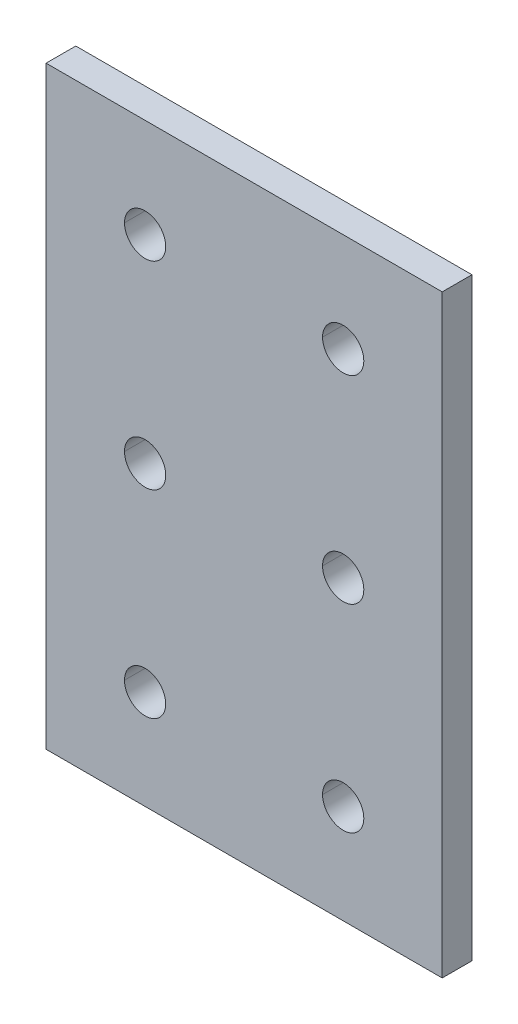
ISO-10303-21;
HEADER;
FILE_DESCRIPTION(('STEP AP214'),'2;1');
FILE_NAME('part.step','',(''),(''),'','','');
FILE_SCHEMA(('AUTOMOTIVE_DESIGN { 1 0 10303 214 1 1 1 1 }'));
ENDSEC;
DATA;
#1=APPLICATION_CONTEXT('core data for automotive mechanical design processes');
#2=APPLICATION_PROTOCOL_DEFINITION('international standard','automotive_design',2000,#1);
#3=PRODUCT_CONTEXT('',#1,'mechanical');
#4=PRODUCT('Part','Part','',(#3));
#5=PRODUCT_RELATED_PRODUCT_CATEGORY('part','',(#4));
#6=PRODUCT_DEFINITION_FORMATION('','',#4);
#7=PRODUCT_DEFINITION_CONTEXT('part definition',#1,'design');
#8=PRODUCT_DEFINITION('design','',#6,#7);
#9=PRODUCT_DEFINITION_SHAPE('','',#8);
#10=(LENGTH_UNIT() NAMED_UNIT(*) SI_UNIT(.MILLI.,.METRE.));
#11=(NAMED_UNIT(*) PLANE_ANGLE_UNIT() SI_UNIT($,.RADIAN.));
#12=(NAMED_UNIT(*) SI_UNIT($,.STERADIAN.) SOLID_ANGLE_UNIT());
#13=UNCERTAINTY_MEASURE_WITH_UNIT(LENGTH_MEASURE(1.E-05),#10,'distance_accuracy_value','');
#14=(GEOMETRIC_REPRESENTATION_CONTEXT(3) GLOBAL_UNCERTAINTY_ASSIGNED_CONTEXT((#13)) GLOBAL_UNIT_ASSIGNED_CONTEXT((#10,
#11,#12)) REPRESENTATION_CONTEXT('',''));
#15=CARTESIAN_POINT('',(0.,0.,0.));
#16=DIRECTION('',(0.,0.,1.));
#17=DIRECTION('',(1.,0.,0.));
#18=AXIS2_PLACEMENT_3D('',#15,#16,#17);
#19=CARTESIAN_POINT('',(40.,120.,6.));
#20=DIRECTION('',(0.,-1.,0.));
#21=DIRECTION('',(0.,0.,-1.));
#22=AXIS2_PLACEMENT_3D('',#19,#20,#21);
#23=PLANE('',#22);
#24=DIRECTION('',(-1.,0.,0.));
#25=VECTOR('',#24,1.);
#26=CARTESIAN_POINT('',(40.,120.,0.));
#27=LINE('',#26,#25);
#28=CARTESIAN_POINT('',(40.,120.,0.));
#29=VERTEX_POINT('',#28);
#30=CARTESIAN_POINT('',(-40.,120.,0.));
#31=VERTEX_POINT('',#30);
#32=EDGE_CURVE('E10',#29,#31,#27,.T.);
#33=ORIENTED_EDGE('',*,*,#32,.T.);
#34=DIRECTION('',(0.,0.,-1.));
#35=VECTOR('',#34,1.);
#36=CARTESIAN_POINT('',(-40.,120.,6.));
#37=LINE('',#36,#35);
#38=CARTESIAN_POINT('',(-40.,120.,6.));
#39=VERTEX_POINT('',#38);
#40=EDGE_CURVE('E24',#39,#31,#37,.T.);
#41=ORIENTED_EDGE('',*,*,#40,.F.);
#42=DIRECTION('',(-1.,0.,0.));
#43=VECTOR('',#42,1.);
#44=CARTESIAN_POINT('',(40.,120.,6.));
#45=LINE('',#44,#43);
#46=CARTESIAN_POINT('',(40.,120.,6.));
#47=VERTEX_POINT('',#46);
#48=EDGE_CURVE('E304',#47,#39,#45,.T.);
#49=ORIENTED_EDGE('',*,*,#48,.F.);
#50=DIRECTION('',(0.,0.,-1.));
#51=VECTOR('',#50,1.);
#52=CARTESIAN_POINT('',(40.,120.,6.));
#53=LINE('',#52,#51);
#54=EDGE_CURVE('E300',#47,#29,#53,.T.);
#55=ORIENTED_EDGE('',*,*,#54,.T.);
#56=EDGE_LOOP('',(#33,#41,#49,#55));
#57=FACE_BOUND('',#56,.T.);
#58=ADVANCED_FACE('F16',(#57),#23,.F.);
#59=CARTESIAN_POINT('',(40.,0.,6.));
#60=DIRECTION('',(-1.,0.,0.));
#61=DIRECTION('',(0.,0.,1.));
#62=AXIS2_PLACEMENT_3D('',#59,#60,#61);
#63=PLANE('',#62);
#64=DIRECTION('',(0.,1.,0.));
#65=VECTOR('',#64,1.);
#66=CARTESIAN_POINT('',(40.,0.,0.));
#67=LINE('',#66,#65);
#68=CARTESIAN_POINT('',(40.,0.,0.));
#69=VERTEX_POINT('',#68);
#70=EDGE_CURVE('E295',#69,#29,#67,.T.);
#71=ORIENTED_EDGE('',*,*,#70,.T.);
#72=ORIENTED_EDGE('',*,*,#54,.F.);
#73=DIRECTION('',(0.,1.,0.));
#74=VECTOR('',#73,1.);
#75=CARTESIAN_POINT('',(40.,0.,6.));
#76=LINE('',#75,#74);
#77=CARTESIAN_POINT('',(40.,0.,6.));
#78=VERTEX_POINT('',#77);
#79=EDGE_CURVE('E290',#78,#47,#76,.T.);
#80=ORIENTED_EDGE('',*,*,#79,.F.);
#81=DIRECTION('',(0.,0.,-1.));
#82=VECTOR('',#81,1.);
#83=CARTESIAN_POINT('',(40.,0.,6.));
#84=LINE('',#83,#82);
#85=EDGE_CURVE('E286',#78,#69,#84,.T.);
#86=ORIENTED_EDGE('',*,*,#85,.T.);
#87=EDGE_LOOP('',(#71,#72,#80,#86));
#88=FACE_BOUND('',#87,.T.);
#89=ADVANCED_FACE('F322',(#88),#63,.F.);
#90=CARTESIAN_POINT('',(-40.,0.,6.));
#91=DIRECTION('',(0.,1.,0.));
#92=DIRECTION('',(0.,0.,1.));
#93=AXIS2_PLACEMENT_3D('',#90,#91,#92);
#94=PLANE('',#93);
#95=DIRECTION('',(1.,0.,0.));
#96=VECTOR('',#95,1.);
#97=CARTESIAN_POINT('',(-40.,0.,0.));
#98=LINE('',#97,#96);
#99=CARTESIAN_POINT('',(-40.,0.,0.));
#100=VERTEX_POINT('',#99);
#101=EDGE_CURVE('E281',#100,#69,#98,.T.);
#102=ORIENTED_EDGE('',*,*,#101,.T.);
#103=ORIENTED_EDGE('',*,*,#85,.F.);
#104=DIRECTION('',(1.,0.,0.));
#105=VECTOR('',#104,1.);
#106=CARTESIAN_POINT('',(-40.,0.,6.));
#107=LINE('',#106,#105);
#108=CARTESIAN_POINT('',(-40.,0.,6.));
#109=VERTEX_POINT('',#108);
#110=EDGE_CURVE('E276',#109,#78,#107,.T.);
#111=ORIENTED_EDGE('',*,*,#110,.F.);
#112=DIRECTION('',(0.,0.,-1.));
#113=VECTOR('',#112,1.);
#114=CARTESIAN_POINT('',(-40.,0.,6.));
#115=LINE('',#114,#113);
#116=EDGE_CURVE('E272',#109,#100,#115,.T.);
#117=ORIENTED_EDGE('',*,*,#116,.T.);
#118=EDGE_LOOP('',(#102,#103,#111,#117));
#119=FACE_BOUND('',#118,.T.);
#120=ADVANCED_FACE('F326',(#119),#94,.F.);
#121=CARTESIAN_POINT('',(-40.,120.,6.));
#122=DIRECTION('',(1.,0.,0.));
#123=DIRECTION('',(0.,0.,-1.));
#124=AXIS2_PLACEMENT_3D('',#121,#122,#123);
#125=PLANE('',#124);
#126=DIRECTION('',(0.,-1.,0.));
#127=VECTOR('',#126,1.);
#128=CARTESIAN_POINT('',(-40.,120.,0.));
#129=LINE('',#128,#127);
#130=EDGE_CURVE('E267',#31,#100,#129,.T.);
#131=ORIENTED_EDGE('',*,*,#130,.T.);
#132=ORIENTED_EDGE('',*,*,#116,.F.);
#133=DIRECTION('',(0.,-1.,0.));
#134=VECTOR('',#133,1.);
#135=CARTESIAN_POINT('',(-40.,120.,6.));
#136=LINE('',#135,#134);
#137=EDGE_CURVE('E262',#39,#109,#136,.T.);
#138=ORIENTED_EDGE('',*,*,#137,.F.);
#139=ORIENTED_EDGE('',*,*,#40,.T.);
#140=EDGE_LOOP('',(#131,#132,#138,#139));
#141=FACE_BOUND('',#140,.T.);
#142=ADVANCED_FACE('F314',(#141),#125,.F.);
#143=CARTESIAN_POINT('',(0.,0.,6.));
#144=DIRECTION('',(0.,0.,1.));
#145=DIRECTION('',(1.,0.,0.));
#146=AXIS2_PLACEMENT_3D('',#143,#144,#145);
#147=PLANE('',#146);
#148=CARTESIAN_POINT('',(-20.,100.,6.));
#149=DIRECTION('',(0.,0.,1.));
#150=DIRECTION('',(1.,0.,0.));
#151=AXIS2_PLACEMENT_3D('',#148,#149,#150);
#152=CIRCLE('',#151,4.165);
#153=CARTESIAN_POINT('',(-24.165,100.,6.));
#154=VERTEX_POINT('',#153);
#155=CARTESIAN_POINT('',(-15.835,100.,6.));
#156=VERTEX_POINT('',#155);
#157=EDGE_CURVE('E257',#154,#156,#152,.T.);
#158=ORIENTED_EDGE('',*,*,#157,.F.);
#159=CARTESIAN_POINT('',(-20.,100.,6.));
#160=DIRECTION('',(0.,0.,1.));
#161=DIRECTION('',(1.,0.,0.));
#162=AXIS2_PLACEMENT_3D('',#159,#160,#161);
#163=CIRCLE('',#162,4.165);
#164=EDGE_CURVE('E252',#156,#154,#163,.T.);
#165=ORIENTED_EDGE('',*,*,#164,.F.);
#166=EDGE_LOOP('',(#158,#165));
#167=FACE_BOUND('',#166,.T.);
#168=CARTESIAN_POINT('',(-20.,60.,6.));
#169=DIRECTION('',(0.,0.,1.));
#170=DIRECTION('',(1.,0.,0.));
#171=AXIS2_PLACEMENT_3D('',#168,#169,#170);
#172=CIRCLE('',#171,4.165);
#173=CARTESIAN_POINT('',(-24.165,60.,6.));
#174=VERTEX_POINT('',#173);
#175=CARTESIAN_POINT('',(-15.835,60.,6.));
#176=VERTEX_POINT('',#175);
#177=EDGE_CURVE('E247',#174,#176,#172,.T.);
#178=ORIENTED_EDGE('',*,*,#177,.F.);
#179=CARTESIAN_POINT('',(-20.,60.,6.));
#180=DIRECTION('',(0.,0.,1.));
#181=DIRECTION('',(1.,0.,0.));
#182=AXIS2_PLACEMENT_3D('',#179,#180,#181);
#183=CIRCLE('',#182,4.165);
#184=EDGE_CURVE('E242',#176,#174,#183,.T.);
#185=ORIENTED_EDGE('',*,*,#184,.F.);
#186=EDGE_LOOP('',(#178,#185));
#187=FACE_BOUND('',#186,.T.);
#188=CARTESIAN_POINT('',(-20.,20.,6.));
#189=DIRECTION('',(0.,0.,1.));
#190=DIRECTION('',(1.,0.,0.));
#191=AXIS2_PLACEMENT_3D('',#188,#189,#190);
#192=CIRCLE('',#191,4.165);
#193=CARTESIAN_POINT('',(-24.165,20.,6.));
#194=VERTEX_POINT('',#193);
#195=CARTESIAN_POINT('',(-15.835,20.,6.));
#196=VERTEX_POINT('',#195);
#197=EDGE_CURVE('E237',#194,#196,#192,.T.);
#198=ORIENTED_EDGE('',*,*,#197,.F.);
#199=CARTESIAN_POINT('',(-20.,20.,6.));
#200=DIRECTION('',(0.,0.,1.));
#201=DIRECTION('',(1.,0.,0.));
#202=AXIS2_PLACEMENT_3D('',#199,#200,#201);
#203=CIRCLE('',#202,4.165);
#204=EDGE_CURVE('E232',#196,#194,#203,.T.);
#205=ORIENTED_EDGE('',*,*,#204,.F.);
#206=EDGE_LOOP('',(#198,#205));
#207=FACE_BOUND('',#206,.T.);
#208=CARTESIAN_POINT('',(20.,100.,6.));
#209=DIRECTION('',(0.,0.,1.));
#210=DIRECTION('',(1.,0.,0.));
#211=AXIS2_PLACEMENT_3D('',#208,#209,#210);
#212=CIRCLE('',#211,4.165);
#213=CARTESIAN_POINT('',(15.835,100.,6.));
#214=VERTEX_POINT('',#213);
#215=CARTESIAN_POINT('',(24.165,100.,6.));
#216=VERTEX_POINT('',#215);
#217=EDGE_CURVE('E227',#214,#216,#212,.T.);
#218=ORIENTED_EDGE('',*,*,#217,.F.);
#219=CARTESIAN_POINT('',(20.,100.,6.));
#220=DIRECTION('',(0.,0.,1.));
#221=DIRECTION('',(1.,0.,0.));
#222=AXIS2_PLACEMENT_3D('',#219,#220,#221);
#223=CIRCLE('',#222,4.165);
#224=EDGE_CURVE('E222',#216,#214,#223,.T.);
#225=ORIENTED_EDGE('',*,*,#224,.F.);
#226=EDGE_LOOP('',(#218,#225));
#227=FACE_BOUND('',#226,.T.);
#228=CARTESIAN_POINT('',(20.,60.,6.));
#229=DIRECTION('',(0.,0.,1.));
#230=DIRECTION('',(1.,0.,0.));
#231=AXIS2_PLACEMENT_3D('',#228,#229,#230);
#232=CIRCLE('',#231,4.165);
#233=CARTESIAN_POINT('',(15.835,60.,6.));
#234=VERTEX_POINT('',#233);
#235=CARTESIAN_POINT('',(24.165,60.,6.));
#236=VERTEX_POINT('',#235);
#237=EDGE_CURVE('E145',#234,#236,#232,.T.);
#238=ORIENTED_EDGE('',*,*,#237,.F.);
#239=CARTESIAN_POINT('',(20.,60.,6.));
#240=DIRECTION('',(0.,0.,1.));
#241=DIRECTION('',(1.,0.,0.));
#242=AXIS2_PLACEMENT_3D('',#239,#240,#241);
#243=CIRCLE('',#242,4.165);
#244=EDGE_CURVE('E215',#236,#234,#243,.T.);
#245=ORIENTED_EDGE('',*,*,#244,.F.);
#246=EDGE_LOOP('',(#238,#245));
#247=FACE_BOUND('',#246,.T.);
#248=CARTESIAN_POINT('',(20.,20.,6.));
#249=DIRECTION('',(0.,0.,1.));
#250=DIRECTION('',(1.,0.,0.));
#251=AXIS2_PLACEMENT_3D('',#248,#249,#250);
#252=CIRCLE('',#251,4.165);
#253=CARTESIAN_POINT('',(15.835,20.,6.));
#254=VERTEX_POINT('',#253);
#255=CARTESIAN_POINT('',(24.165,20.,6.));
#256=VERTEX_POINT('',#255);
#257=EDGE_CURVE('E210',#254,#256,#252,.T.);
#258=ORIENTED_EDGE('',*,*,#257,.F.);
#259=CARTESIAN_POINT('',(20.,20.,6.));
#260=DIRECTION('',(0.,0.,1.));
#261=DIRECTION('',(1.,0.,0.));
#262=AXIS2_PLACEMENT_3D('',#259,#260,#261);
#263=CIRCLE('',#262,4.165);
#264=EDGE_CURVE('E205',#256,#254,#263,.T.);
#265=ORIENTED_EDGE('',*,*,#264,.F.);
#266=EDGE_LOOP('',(#258,#265));
#267=FACE_BOUND('',#266,.T.);
#268=ORIENTED_EDGE('',*,*,#48,.T.);
#269=ORIENTED_EDGE('',*,*,#137,.T.);
#270=ORIENTED_EDGE('',*,*,#110,.T.);
#271=ORIENTED_EDGE('',*,*,#79,.T.);
#272=EDGE_LOOP('',(#268,#269,#270,#271));
#273=FACE_BOUND('',#272,.T.);
#274=ADVANCED_FACE('F318',(#167,#187,#207,#227,#247,#267,#273),#147,.T.);
#275=CARTESIAN_POINT('',(20.,20.,6.));
#276=DIRECTION('',(0.,0.,-1.));
#277=DIRECTION('',(0.,-1.,0.));
#278=AXIS2_PLACEMENT_3D('',#275,#276,#277);
#279=CYLINDRICAL_SURFACE('',#278,4.165);
#280=DIRECTION('',(0.,0.,-1.));
#281=VECTOR('',#280,1.);
#282=CARTESIAN_POINT('',(24.165,20.,6.));
#283=LINE('',#282,#281);
#284=CARTESIAN_POINT('',(24.165,20.,0.));
#285=VERTEX_POINT('',#284);
#286=EDGE_CURVE('E200',#256,#285,#283,.T.);
#287=ORIENTED_EDGE('',*,*,#286,.F.);
#288=ORIENTED_EDGE('',*,*,#264,.T.);
#289=DIRECTION('',(0.,0.,-1.));
#290=VECTOR('',#289,1.);
#291=CARTESIAN_POINT('',(15.835,20.,6.));
#292=LINE('',#291,#290);
#293=CARTESIAN_POINT('',(15.835,20.,0.));
#294=VERTEX_POINT('',#293);
#295=EDGE_CURVE('E196',#254,#294,#292,.T.);
#296=ORIENTED_EDGE('',*,*,#295,.T.);
#297=CARTESIAN_POINT('',(20.,20.,0.));
#298=DIRECTION('',(0.,0.,1.));
#299=DIRECTION('',(1.,0.,0.));
#300=AXIS2_PLACEMENT_3D('',#297,#298,#299);
#301=CIRCLE('',#300,4.165);
#302=EDGE_CURVE('E191',#285,#294,#301,.T.);
#303=ORIENTED_EDGE('',*,*,#302,.F.);
#304=EDGE_LOOP('',(#287,#288,#296,#303));
#305=FACE_BOUND('',#304,.T.);
#306=ADVANCED_FACE('F369',(#305),#279,.F.);
#307=CARTESIAN_POINT('',(0.,0.,0.));
#308=DIRECTION('',(0.,0.,1.));
#309=DIRECTION('',(1.,0.,0.));
#310=AXIS2_PLACEMENT_3D('',#307,#308,#309);
#311=PLANE('',#310);
#312=CARTESIAN_POINT('',(-20.,100.,0.));
#313=DIRECTION('',(0.,0.,1.));
#314=DIRECTION('',(1.,0.,0.));
#315=AXIS2_PLACEMENT_3D('',#312,#313,#314);
#316=CIRCLE('',#315,4.165);
#317=CARTESIAN_POINT('',(-15.835,100.,0.));
#318=VERTEX_POINT('',#317);
#319=CARTESIAN_POINT('',(-24.165,100.,0.));
#320=VERTEX_POINT('',#319);
#321=EDGE_CURVE('E187',#318,#320,#316,.T.);
#322=ORIENTED_EDGE('',*,*,#321,.T.);
#323=CARTESIAN_POINT('',(-20.,100.,0.));
#324=DIRECTION('',(0.,0.,1.));
#325=DIRECTION('',(1.,0.,0.));
#326=AXIS2_PLACEMENT_3D('',#323,#324,#325);
#327=CIRCLE('',#326,4.165);
#328=EDGE_CURVE('E183',#320,#318,#327,.T.);
#329=ORIENTED_EDGE('',*,*,#328,.T.);
#330=EDGE_LOOP('',(#322,#329));
#331=FACE_BOUND('',#330,.T.);
#332=CARTESIAN_POINT('',(-20.,60.,0.));
#333=DIRECTION('',(0.,0.,1.));
#334=DIRECTION('',(1.,0.,0.));
#335=AXIS2_PLACEMENT_3D('',#332,#333,#334);
#336=CIRCLE('',#335,4.165);
#337=CARTESIAN_POINT('',(-15.835,60.,0.));
#338=VERTEX_POINT('',#337);
#339=CARTESIAN_POINT('',(-24.165,60.,0.));
#340=VERTEX_POINT('',#339);
#341=EDGE_CURVE('E179',#338,#340,#336,.T.);
#342=ORIENTED_EDGE('',*,*,#341,.T.);
#343=CARTESIAN_POINT('',(-20.,60.,0.));
#344=DIRECTION('',(0.,0.,1.));
#345=DIRECTION('',(1.,0.,0.));
#346=AXIS2_PLACEMENT_3D('',#343,#344,#345);
#347=CIRCLE('',#346,4.165);
#348=EDGE_CURVE('E175',#340,#338,#347,.T.);
#349=ORIENTED_EDGE('',*,*,#348,.T.);
#350=EDGE_LOOP('',(#342,#349));
#351=FACE_BOUND('',#350,.T.);
#352=CARTESIAN_POINT('',(-20.,20.,0.));
#353=DIRECTION('',(0.,0.,1.));
#354=DIRECTION('',(1.,0.,0.));
#355=AXIS2_PLACEMENT_3D('',#352,#353,#354);
#356=CIRCLE('',#355,4.165);
#357=CARTESIAN_POINT('',(-15.835,20.,0.));
#358=VERTEX_POINT('',#357);
#359=CARTESIAN_POINT('',(-24.165,20.,0.));
#360=VERTEX_POINT('',#359);
#361=EDGE_CURVE('E171',#358,#360,#356,.T.);
#362=ORIENTED_EDGE('',*,*,#361,.T.);
#363=CARTESIAN_POINT('',(-20.,20.,0.));
#364=DIRECTION('',(0.,0.,1.));
#365=DIRECTION('',(1.,0.,0.));
#366=AXIS2_PLACEMENT_3D('',#363,#364,#365);
#367=CIRCLE('',#366,4.165);
#368=EDGE_CURVE('E167',#360,#358,#367,.T.);
#369=ORIENTED_EDGE('',*,*,#368,.T.);
#370=EDGE_LOOP('',(#362,#369));
#371=FACE_BOUND('',#370,.T.);
#372=CARTESIAN_POINT('',(20.,100.,0.));
#373=DIRECTION('',(0.,0.,1.));
#374=DIRECTION('',(1.,0.,0.));
#375=AXIS2_PLACEMENT_3D('',#372,#373,#374);
#376=CIRCLE('',#375,4.165);
#377=CARTESIAN_POINT('',(24.165,100.,0.));
#378=VERTEX_POINT('',#377);
#379=CARTESIAN_POINT('',(15.835,100.,0.));
#380=VERTEX_POINT('',#379);
#381=EDGE_CURVE('E163',#378,#380,#376,.T.);
#382=ORIENTED_EDGE('',*,*,#381,.T.);
#383=CARTESIAN_POINT('',(20.,100.,0.));
#384=DIRECTION('',(0.,0.,1.));
#385=DIRECTION('',(1.,0.,0.));
#386=AXIS2_PLACEMENT_3D('',#383,#384,#385);
#387=CIRCLE('',#386,4.165);
#388=EDGE_CURVE('E142',#380,#378,#387,.T.);
#389=ORIENTED_EDGE('',*,*,#388,.T.);
#390=EDGE_LOOP('',(#382,#389));
#391=FACE_BOUND('',#390,.T.);
#392=CARTESIAN_POINT('',(20.,60.,0.));
#393=DIRECTION('',(0.,0.,1.));
#394=DIRECTION('',(1.,0.,0.));
#395=AXIS2_PLACEMENT_3D('',#392,#393,#394);
#396=CIRCLE('',#395,4.165);
#397=CARTESIAN_POINT('',(24.165,60.,0.));
#398=VERTEX_POINT('',#397);
#399=CARTESIAN_POINT('',(15.835,60.,0.));
#400=VERTEX_POINT('',#399);
#401=EDGE_CURVE('E128',#398,#400,#396,.T.);
#402=ORIENTED_EDGE('',*,*,#401,.T.);
#403=CARTESIAN_POINT('',(20.,60.,0.));
#404=DIRECTION('',(0.,0.,1.));
#405=DIRECTION('',(1.,0.,0.));
#406=AXIS2_PLACEMENT_3D('',#403,#404,#405);
#407=CIRCLE('',#406,4.165);
#408=EDGE_CURVE('E124',#400,#398,#407,.T.);
#409=ORIENTED_EDGE('',*,*,#408,.T.);
#410=EDGE_LOOP('',(#402,#409));
#411=FACE_BOUND('',#410,.T.);
#412=ORIENTED_EDGE('',*,*,#302,.T.);
#413=CARTESIAN_POINT('',(20.,20.,0.));
#414=DIRECTION('',(0.,0.,1.));
#415=DIRECTION('',(1.,0.,0.));
#416=AXIS2_PLACEMENT_3D('',#413,#414,#415);
#417=CIRCLE('',#416,4.165);
#418=EDGE_CURVE('E133',#294,#285,#417,.T.);
#419=ORIENTED_EDGE('',*,*,#418,.T.);
#420=EDGE_LOOP('',(#412,#419));
#421=FACE_BOUND('',#420,.T.);
#422=ORIENTED_EDGE('',*,*,#32,.F.);
#423=ORIENTED_EDGE('',*,*,#70,.F.);
#424=ORIENTED_EDGE('',*,*,#101,.F.);
#425=ORIENTED_EDGE('',*,*,#130,.F.);
#426=EDGE_LOOP('',(#422,#423,#424,#425));
#427=FACE_BOUND('',#426,.T.);
#428=ADVANCED_FACE('F126',(#331,#351,#371,#391,#411,#421,#427),#311,.F.);
#429=CARTESIAN_POINT('',(20.,20.,6.));
#430=DIRECTION('',(0.,0.,-1.));
#431=DIRECTION('',(0.,1.,0.));
#432=AXIS2_PLACEMENT_3D('',#429,#430,#431);
#433=CYLINDRICAL_SURFACE('',#432,4.165);
#434=ORIENTED_EDGE('',*,*,#286,.T.);
#435=ORIENTED_EDGE('',*,*,#418,.F.);
#436=ORIENTED_EDGE('',*,*,#295,.F.);
#437=ORIENTED_EDGE('',*,*,#257,.T.);
#438=EDGE_LOOP('',(#434,#435,#436,#437));
#439=FACE_BOUND('',#438,.T.);
#440=ADVANCED_FACE('F390',(#439),#433,.F.);
#441=CARTESIAN_POINT('',(20.,60.,6.));
#442=DIRECTION('',(0.,0.,-1.));
#443=DIRECTION('',(0.,1.,0.));
#444=AXIS2_PLACEMENT_3D('',#441,#442,#443);
#445=CYLINDRICAL_SURFACE('',#444,4.165);
#446=DIRECTION('',(0.,0.,-1.));
#447=VECTOR('',#446,1.);
#448=CARTESIAN_POINT('',(24.165,60.,6.));
#449=LINE('',#448,#447);
#450=EDGE_CURVE('E139',#236,#398,#449,.T.);
#451=ORIENTED_EDGE('',*,*,#450,.T.);
#452=ORIENTED_EDGE('',*,*,#408,.F.);
#453=DIRECTION('',(0.,0.,-1.));
#454=VECTOR('',#453,1.);
#455=CARTESIAN_POINT('',(15.835,60.,6.));
#456=LINE('',#455,#454);
#457=EDGE_CURVE('E141',#234,#400,#456,.T.);
#458=ORIENTED_EDGE('',*,*,#457,.F.);
#459=ORIENTED_EDGE('',*,*,#237,.T.);
#460=EDGE_LOOP('',(#451,#452,#458,#459));
#461=FACE_BOUND('',#460,.T.);
#462=ADVANCED_FACE('F144',(#461),#445,.F.);
#463=CARTESIAN_POINT('',(20.,60.,6.));
#464=DIRECTION('',(0.,0.,-1.));
#465=DIRECTION('',(0.,-1.,0.));
#466=AXIS2_PLACEMENT_3D('',#463,#464,#465);
#467=CYLINDRICAL_SURFACE('',#466,4.165);
#468=ORIENTED_EDGE('',*,*,#450,.F.);
#469=ORIENTED_EDGE('',*,*,#244,.T.);
#470=ORIENTED_EDGE('',*,*,#457,.T.);
#471=ORIENTED_EDGE('',*,*,#401,.F.);
#472=EDGE_LOOP('',(#468,#469,#470,#471));
#473=FACE_BOUND('',#472,.T.);
#474=ADVANCED_FACE('F137',(#473),#467,.F.);
#475=CARTESIAN_POINT('',(20.,100.,6.));
#476=DIRECTION('',(0.,0.,-1.));
#477=DIRECTION('',(0.,1.,0.));
#478=AXIS2_PLACEMENT_3D('',#475,#476,#477);
#479=CYLINDRICAL_SURFACE('',#478,4.165);
#480=DIRECTION('',(0.,0.,-1.));
#481=VECTOR('',#480,1.);
#482=CARTESIAN_POINT('',(24.165,100.,6.));
#483=LINE('',#482,#481);
#484=EDGE_CURVE('E149',#216,#378,#483,.T.);
#485=ORIENTED_EDGE('',*,*,#484,.T.);
#486=ORIENTED_EDGE('',*,*,#388,.F.);
#487=DIRECTION('',(0.,0.,-1.));
#488=VECTOR('',#487,1.);
#489=CARTESIAN_POINT('',(15.835,100.,6.));
#490=LINE('',#489,#488);
#491=EDGE_CURVE('E562',#214,#380,#490,.T.);
#492=ORIENTED_EDGE('',*,*,#491,.F.);
#493=ORIENTED_EDGE('',*,*,#217,.T.);
#494=EDGE_LOOP('',(#485,#486,#492,#493));
#495=FACE_BOUND('',#494,.T.);
#496=ADVANCED_FACE('F420',(#495),#479,.F.);
#497=CARTESIAN_POINT('',(20.,100.,6.));
#498=DIRECTION('',(0.,0.,-1.));
#499=DIRECTION('',(0.,-1.,0.));
#500=AXIS2_PLACEMENT_3D('',#497,#498,#499);
#501=CYLINDRICAL_SURFACE('',#500,4.165);
#502=ORIENTED_EDGE('',*,*,#484,.F.);
#503=ORIENTED_EDGE('',*,*,#224,.T.);
#504=ORIENTED_EDGE('',*,*,#491,.T.);
#505=ORIENTED_EDGE('',*,*,#381,.F.);
#506=EDGE_LOOP('',(#502,#503,#504,#505));
#507=FACE_BOUND('',#506,.T.);
#508=ADVANCED_FACE('F430',(#507),#501,.F.);
#509=CARTESIAN_POINT('',(-20.,20.,6.));
#510=DIRECTION('',(0.,0.,-1.));
#511=DIRECTION('',(0.,1.,0.));
#512=AXIS2_PLACEMENT_3D('',#509,#510,#511);
#513=CYLINDRICAL_SURFACE('',#512,4.165);
#514=DIRECTION('',(0.,0.,-1.));
#515=VECTOR('',#514,1.);
#516=CARTESIAN_POINT('',(-15.835,20.,6.));
#517=LINE('',#516,#515);
#518=EDGE_CURVE('E564',#196,#358,#517,.T.);
#519=ORIENTED_EDGE('',*,*,#518,.T.);
#520=ORIENTED_EDGE('',*,*,#368,.F.);
#521=DIRECTION('',(0.,0.,-1.));
#522=VECTOR('',#521,1.);
#523=CARTESIAN_POINT('',(-24.165,20.,6.));
#524=LINE('',#523,#522);
#525=EDGE_CURVE('E576',#194,#360,#524,.T.);
#526=ORIENTED_EDGE('',*,*,#525,.F.);
#527=ORIENTED_EDGE('',*,*,#197,.T.);
#528=EDGE_LOOP('',(#519,#520,#526,#527));
#529=FACE_BOUND('',#528,.T.);
#530=ADVANCED_FACE('F441',(#529),#513,.F.);
#531=CARTESIAN_POINT('',(-20.,20.,6.));
#532=DIRECTION('',(0.,0.,-1.));
#533=DIRECTION('',(0.,-1.,0.));
#534=AXIS2_PLACEMENT_3D('',#531,#532,#533);
#535=CYLINDRICAL_SURFACE('',#534,4.165);
#536=ORIENTED_EDGE('',*,*,#518,.F.);
#537=ORIENTED_EDGE('',*,*,#204,.T.);
#538=ORIENTED_EDGE('',*,*,#525,.T.);
#539=ORIENTED_EDGE('',*,*,#361,.F.);
#540=EDGE_LOOP('',(#536,#537,#538,#539));
#541=FACE_BOUND('',#540,.T.);
#542=ADVANCED_FACE('F452',(#541),#535,.F.);
#543=CARTESIAN_POINT('',(-20.,60.,6.));
#544=DIRECTION('',(0.,0.,-1.));
#545=DIRECTION('',(0.,1.,0.));
#546=AXIS2_PLACEMENT_3D('',#543,#544,#545);
#547=CYLINDRICAL_SURFACE('',#546,4.165);
#548=DIRECTION('',(0.,0.,-1.));
#549=VECTOR('',#548,1.);
#550=CARTESIAN_POINT('',(-15.835,60.,6.));
#551=LINE('',#550,#549);
#552=EDGE_CURVE('E581',#176,#338,#551,.T.);
#553=ORIENTED_EDGE('',*,*,#552,.T.);
#554=ORIENTED_EDGE('',*,*,#348,.F.);
#555=DIRECTION('',(0.,0.,-1.));
#556=VECTOR('',#555,1.);
#557=CARTESIAN_POINT('',(-24.165,60.,6.));
#558=LINE('',#557,#556);
#559=EDGE_CURVE('E543',#174,#340,#558,.T.);
#560=ORIENTED_EDGE('',*,*,#559,.F.);
#561=ORIENTED_EDGE('',*,*,#177,.T.);
#562=EDGE_LOOP('',(#553,#554,#560,#561));
#563=FACE_BOUND('',#562,.T.);
#564=ADVANCED_FACE('F463',(#563),#547,.F.);
#565=CARTESIAN_POINT('',(-20.,60.,6.));
#566=DIRECTION('',(0.,0.,-1.));
#567=DIRECTION('',(0.,-1.,0.));
#568=AXIS2_PLACEMENT_3D('',#565,#566,#567);
#569=CYLINDRICAL_SURFACE('',#568,4.165);
#570=ORIENTED_EDGE('',*,*,#552,.F.);
#571=ORIENTED_EDGE('',*,*,#184,.T.);
#572=ORIENTED_EDGE('',*,*,#559,.T.);
#573=ORIENTED_EDGE('',*,*,#341,.F.);
#574=EDGE_LOOP('',(#570,#571,#572,#573));
#575=FACE_BOUND('',#574,.T.);
#576=ADVANCED_FACE('F474',(#575),#569,.F.);
#577=CARTESIAN_POINT('',(-20.,100.,6.));
#578=DIRECTION('',(0.,0.,-1.));
#579=DIRECTION('',(0.,1.,0.));
#580=AXIS2_PLACEMENT_3D('',#577,#578,#579);
#581=CYLINDRICAL_SURFACE('',#580,4.165);
#582=DIRECTION('',(0.,0.,-1.));
#583=VECTOR('',#582,1.);
#584=CARTESIAN_POINT('',(-15.835,100.,6.));
#585=LINE('',#584,#583);
#586=EDGE_CURVE('E540',#156,#318,#585,.T.);
#587=ORIENTED_EDGE('',*,*,#586,.T.);
#588=ORIENTED_EDGE('',*,*,#328,.F.);
#589=DIRECTION('',(0.,0.,-1.));
#590=VECTOR('',#589,1.);
#591=CARTESIAN_POINT('',(-24.165,100.,6.));
#592=LINE('',#591,#590);
#593=EDGE_CURVE('E544',#154,#320,#592,.T.);
#594=ORIENTED_EDGE('',*,*,#593,.F.);
#595=ORIENTED_EDGE('',*,*,#157,.T.);
#596=EDGE_LOOP('',(#587,#588,#594,#595));
#597=FACE_BOUND('',#596,.T.);
#598=ADVANCED_FACE('F485',(#597),#581,.F.);
#599=CARTESIAN_POINT('',(-20.,100.,6.));
#600=DIRECTION('',(0.,0.,-1.));
#601=DIRECTION('',(0.,-1.,0.));
#602=AXIS2_PLACEMENT_3D('',#599,#600,#601);
#603=CYLINDRICAL_SURFACE('',#602,4.165);
#604=ORIENTED_EDGE('',*,*,#586,.F.);
#605=ORIENTED_EDGE('',*,*,#164,.T.);
#606=ORIENTED_EDGE('',*,*,#593,.T.);
#607=ORIENTED_EDGE('',*,*,#321,.F.);
#608=EDGE_LOOP('',(#604,#605,#606,#607));
#609=FACE_BOUND('',#608,.T.);
#610=ADVANCED_FACE('F496',(#609),#603,.F.);
#611=CLOSED_SHELL('',(#58,#89,#120,#142,#274,#306,#428,#440,#462,#474,#496,#508,#530,#542,#564,
#576,#598,#610));
#612=MANIFOLD_SOLID_BREP('B1',#611);
#613=ADVANCED_BREP_SHAPE_REPRESENTATION('',(#18,#612),#14);
#614=SHAPE_DEFINITION_REPRESENTATION(#9,#613);
ENDSEC;
END-ISO-10303-21;
